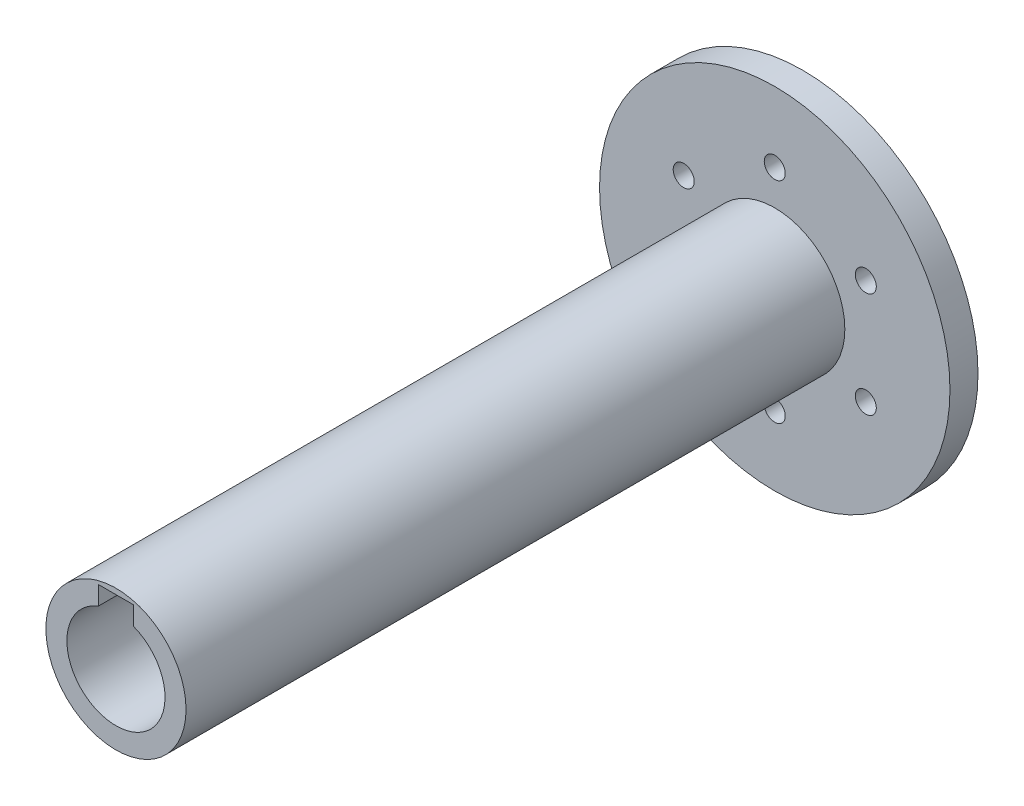
ISO-10303-21;
HEADER;
FILE_DESCRIPTION(('STEP AP214'),'2;1');
FILE_NAME('part.step','',(''),(''),'','','');
FILE_SCHEMA(('AUTOMOTIVE_DESIGN { 1 0 10303 214 1 1 1 1 }'));
ENDSEC;
DATA;
#1=APPLICATION_CONTEXT('core data for automotive mechanical design processes');
#2=APPLICATION_PROTOCOL_DEFINITION('international standard','automotive_design',2000,#1);
#3=PRODUCT_CONTEXT('',#1,'mechanical');
#4=PRODUCT('Part','Part','',(#3));
#5=PRODUCT_RELATED_PRODUCT_CATEGORY('part','',(#4));
#6=PRODUCT_DEFINITION_FORMATION('','',#4);
#7=PRODUCT_DEFINITION_CONTEXT('part definition',#1,'design');
#8=PRODUCT_DEFINITION('design','',#6,#7);
#9=PRODUCT_DEFINITION_SHAPE('','',#8);
#10=(LENGTH_UNIT() NAMED_UNIT(*) SI_UNIT(.MILLI.,.METRE.));
#11=(NAMED_UNIT(*) PLANE_ANGLE_UNIT() SI_UNIT($,.RADIAN.));
#12=(NAMED_UNIT(*) SI_UNIT($,.STERADIAN.) SOLID_ANGLE_UNIT());
#13=UNCERTAINTY_MEASURE_WITH_UNIT(LENGTH_MEASURE(1.E-05),#10,'distance_accuracy_value','');
#14=(GEOMETRIC_REPRESENTATION_CONTEXT(3) GLOBAL_UNCERTAINTY_ASSIGNED_CONTEXT((#13)) GLOBAL_UNIT_ASSIGNED_CONTEXT((#10,
#11,#12)) REPRESENTATION_CONTEXT('',''));
#15=CARTESIAN_POINT('',(0.,0.,0.));
#16=DIRECTION('',(0.,0.,1.));
#17=DIRECTION('',(1.,0.,0.));
#18=AXIS2_PLACEMENT_3D('',#15,#16,#17);
#19=CARTESIAN_POINT('',(0.,0.,94.));
#20=DIRECTION('',(0.,0.,-1.));
#21=DIRECTION('',(-1.,0.,0.));
#22=AXIS2_PLACEMENT_3D('',#19,#20,#21);
#23=CYLINDRICAL_SURFACE('',#22,10.);
#24=CARTESIAN_POINT('',(0.,0.,94.));
#25=DIRECTION('',(0.,0.,1.));
#26=DIRECTION('',(1.,0.,0.));
#27=AXIS2_PLACEMENT_3D('',#24,#25,#26);
#28=CIRCLE('',#27,10.);
#29=CARTESIAN_POINT('',(10.,0.,94.));
#30=VERTEX_POINT('',#29);
#31=EDGE_CURVE('E11',#30,#30,#28,.T.);
#32=ORIENTED_EDGE('',*,*,#31,.F.);
#33=EDGE_LOOP('',(#32));
#34=FACE_BOUND('',#33,.T.);
#35=CARTESIAN_POINT('',(0.,0.,0.));
#36=DIRECTION('',(0.,0.,1.));
#37=DIRECTION('',(1.,0.,0.));
#38=AXIS2_PLACEMENT_3D('',#35,#36,#37);
#39=CIRCLE('',#38,10.);
#40=CARTESIAN_POINT('',(10.,0.,0.));
#41=VERTEX_POINT('',#40);
#42=EDGE_CURVE('E130',#41,#41,#39,.T.);
#43=ORIENTED_EDGE('',*,*,#42,.T.);
#44=EDGE_LOOP('',(#43));
#45=FACE_BOUND('',#44,.T.);
#46=ADVANCED_FACE('F39',(#34,#45),#23,.T.);
#47=CARTESIAN_POINT('',(0.,0.,94.));
#48=DIRECTION('',(0.,0.,1.));
#49=DIRECTION('',(1.,0.,0.));
#50=AXIS2_PLACEMENT_3D('',#47,#48,#49);
#51=PLANE('',#50);
#52=DIRECTION('',(0.,1.,0.));
#53=VECTOR('',#52,1.);
#54=CARTESIAN_POINT('',(2.5,6.53834841531101,94.));
#55=LINE('',#54,#53);
#56=CARTESIAN_POINT('',(2.5,6.53834841531101,94.));
#57=VERTEX_POINT('',#56);
#58=CARTESIAN_POINT('',(2.5,9.2,94.));
#59=VERTEX_POINT('',#58);
#60=EDGE_CURVE('E56',#57,#59,#55,.T.);
#61=ORIENTED_EDGE('',*,*,#60,.F.);
#62=CARTESIAN_POINT('',(0.,0.,94.));
#63=DIRECTION('',(0.,0.,1.));
#64=DIRECTION('',(1.,0.,0.));
#65=AXIS2_PLACEMENT_3D('',#62,#63,#64);
#66=CIRCLE('',#65,7.);
#67=CARTESIAN_POINT('',(-2.5,6.53834841531101,94.));
#68=VERTEX_POINT('',#67);
#69=EDGE_CURVE('E110',#68,#57,#66,.T.);
#70=ORIENTED_EDGE('',*,*,#69,.F.);
#71=DIRECTION('',(0.,-1.,0.));
#72=VECTOR('',#71,1.);
#73=CARTESIAN_POINT('',(-2.5,6.53834841531101,94.));
#74=LINE('',#73,#72);
#75=CARTESIAN_POINT('',(-2.5,9.2,94.));
#76=VERTEX_POINT('',#75);
#77=EDGE_CURVE('E120',#76,#68,#74,.T.);
#78=ORIENTED_EDGE('',*,*,#77,.F.);
#79=DIRECTION('',(-1.,0.,0.));
#80=VECTOR('',#79,1.);
#81=CARTESIAN_POINT('',(-2.5,9.2,94.));
#82=LINE('',#81,#80);
#83=EDGE_CURVE('E90',#59,#76,#82,.T.);
#84=ORIENTED_EDGE('',*,*,#83,.F.);
#85=EDGE_LOOP('',(#61,#70,#78,#84));
#86=FACE_BOUND('',#85,.T.);
#87=ORIENTED_EDGE('',*,*,#31,.T.);
#88=EDGE_LOOP('',(#87));
#89=FACE_BOUND('',#88,.T.);
#90=ADVANCED_FACE('F223',(#86,#89),#51,.T.);
#91=CARTESIAN_POINT('',(2.5,6.53834841531101,64.));
#92=DIRECTION('',(1.,0.,0.));
#93=DIRECTION('',(0.,0.,-1.));
#94=AXIS2_PLACEMENT_3D('',#91,#92,#93);
#95=PLANE('',#94);
#96=ORIENTED_EDGE('',*,*,#60,.T.);
#97=DIRECTION('',(0.,0.,1.));
#98=VECTOR('',#97,1.);
#99=CARTESIAN_POINT('',(2.5,9.2,64.));
#100=LINE('',#99,#98);
#101=CARTESIAN_POINT('',(2.5,9.2,64.));
#102=VERTEX_POINT('',#101);
#103=EDGE_CURVE('E78',#102,#59,#100,.T.);
#104=ORIENTED_EDGE('',*,*,#103,.F.);
#105=DIRECTION('',(0.,1.,0.));
#106=VECTOR('',#105,1.);
#107=CARTESIAN_POINT('',(2.5,6.53834841531101,64.));
#108=LINE('',#107,#106);
#109=CARTESIAN_POINT('',(2.5,6.53834841531101,64.));
#110=VERTEX_POINT('',#109);
#111=EDGE_CURVE('E106',#110,#102,#108,.T.);
#112=ORIENTED_EDGE('',*,*,#111,.F.);
#113=DIRECTION('',(0.,0.,1.));
#114=VECTOR('',#113,1.);
#115=CARTESIAN_POINT('',(2.5,6.53834841531101,64.));
#116=LINE('',#115,#114);
#117=EDGE_CURVE('E48',#110,#57,#116,.T.);
#118=ORIENTED_EDGE('',*,*,#117,.T.);
#119=EDGE_LOOP('',(#96,#104,#112,#118));
#120=FACE_BOUND('',#119,.T.);
#121=ADVANCED_FACE('F228',(#120),#95,.F.);
#122=CARTESIAN_POINT('',(0.,0.,64.));
#123=DIRECTION('',(0.,0.,1.));
#124=DIRECTION('',(1.,0.,0.));
#125=AXIS2_PLACEMENT_3D('',#122,#123,#124);
#126=CYLINDRICAL_SURFACE('',#125,7.);
#127=ORIENTED_EDGE('',*,*,#69,.T.);
#128=ORIENTED_EDGE('',*,*,#117,.F.);
#129=CARTESIAN_POINT('',(0.,0.,64.));
#130=DIRECTION('',(0.,0.,1.));
#131=DIRECTION('',(1.,0.,0.));
#132=AXIS2_PLACEMENT_3D('',#129,#130,#131);
#133=CIRCLE('',#132,7.);
#134=CARTESIAN_POINT('',(-2.5,6.53834841531101,64.));
#135=VERTEX_POINT('',#134);
#136=EDGE_CURVE('E103',#135,#110,#133,.T.);
#137=ORIENTED_EDGE('',*,*,#136,.F.);
#138=DIRECTION('',(0.,0.,1.));
#139=VECTOR('',#138,1.);
#140=CARTESIAN_POINT('',(-2.5,6.53834841531101,64.));
#141=LINE('',#140,#139);
#142=EDGE_CURVE('E95',#135,#68,#141,.T.);
#143=ORIENTED_EDGE('',*,*,#142,.T.);
#144=EDGE_LOOP('',(#127,#128,#137,#143));
#145=FACE_BOUND('',#144,.T.);
#146=ADVANCED_FACE('F235',(#145),#126,.F.);
#147=CARTESIAN_POINT('',(-2.5,6.53834841531101,64.));
#148=DIRECTION('',(-1.,0.,0.));
#149=DIRECTION('',(0.,0.,1.));
#150=AXIS2_PLACEMENT_3D('',#147,#148,#149);
#151=PLANE('',#150);
#152=ORIENTED_EDGE('',*,*,#77,.T.);
#153=ORIENTED_EDGE('',*,*,#142,.F.);
#154=DIRECTION('',(0.,-1.,0.));
#155=VECTOR('',#154,1.);
#156=CARTESIAN_POINT('',(-2.5,6.53834841531101,64.));
#157=LINE('',#156,#155);
#158=CARTESIAN_POINT('',(-2.5,9.2,64.));
#159=VERTEX_POINT('',#158);
#160=EDGE_CURVE('E98',#159,#135,#157,.T.);
#161=ORIENTED_EDGE('',*,*,#160,.F.);
#162=DIRECTION('',(0.,0.,1.));
#163=VECTOR('',#162,1.);
#164=CARTESIAN_POINT('',(-2.5,9.2,64.));
#165=LINE('',#164,#163);
#166=EDGE_CURVE('E83',#159,#76,#165,.T.);
#167=ORIENTED_EDGE('',*,*,#166,.T.);
#168=EDGE_LOOP('',(#152,#153,#161,#167));
#169=FACE_BOUND('',#168,.T.);
#170=ADVANCED_FACE('F99',(#169),#151,.F.);
#171=CARTESIAN_POINT('',(-2.5,9.2,64.));
#172=DIRECTION('',(0.,1.,0.));
#173=DIRECTION('',(0.,0.,1.));
#174=AXIS2_PLACEMENT_3D('',#171,#172,#173);
#175=PLANE('',#174);
#176=ORIENTED_EDGE('',*,*,#83,.T.);
#177=ORIENTED_EDGE('',*,*,#166,.F.);
#178=DIRECTION('',(-1.,0.,0.));
#179=VECTOR('',#178,1.);
#180=CARTESIAN_POINT('',(-2.5,9.2,64.));
#181=LINE('',#180,#179);
#182=EDGE_CURVE('E87',#102,#159,#181,.T.);
#183=ORIENTED_EDGE('',*,*,#182,.F.);
#184=ORIENTED_EDGE('',*,*,#103,.T.);
#185=EDGE_LOOP('',(#176,#177,#183,#184));
#186=FACE_BOUND('',#185,.T.);
#187=ADVANCED_FACE('F85',(#186),#175,.F.);
#188=CARTESIAN_POINT('',(0.,0.,64.));
#189=DIRECTION('',(0.,0.,1.));
#190=DIRECTION('',(1.,0.,0.));
#191=AXIS2_PLACEMENT_3D('',#188,#189,#190);
#192=PLANE('',#191);
#193=CARTESIAN_POINT('',(0.,0.,64.));
#194=DIRECTION('',(0.,0.,1.));
#195=DIRECTION('',(1.,0.,0.));
#196=AXIS2_PLACEMENT_3D('',#193,#194,#195);
#197=CIRCLE('',#196,1.5);
#198=CARTESIAN_POINT('',(1.5,0.,64.));
#199=VERTEX_POINT('',#198);
#200=EDGE_CURVE('E42',#199,#199,#197,.T.);
#201=ORIENTED_EDGE('',*,*,#200,.F.);
#202=EDGE_LOOP('',(#201));
#203=FACE_BOUND('',#202,.T.);
#204=ORIENTED_EDGE('',*,*,#111,.T.);
#205=ORIENTED_EDGE('',*,*,#182,.T.);
#206=ORIENTED_EDGE('',*,*,#160,.T.);
#207=ORIENTED_EDGE('',*,*,#136,.T.);
#208=EDGE_LOOP('',(#204,#205,#206,#207));
#209=FACE_BOUND('',#208,.T.);
#210=ADVANCED_FACE('F105',(#203,#209),#192,.T.);
#211=CARTESIAN_POINT('',(0.,0.,94.));
#212=DIRECTION('',(0.,0.,-1.));
#213=DIRECTION('',(-1.,0.,0.));
#214=AXIS2_PLACEMENT_3D('',#211,#212,#213);
#215=CYLINDRICAL_SURFACE('',#214,1.5);
#216=ORIENTED_EDGE('',*,*,#200,.T.);
#217=EDGE_LOOP('',(#216));
#218=FACE_BOUND('',#217,.T.);
#219=CARTESIAN_POINT('',(0.,0.,-4.));
#220=DIRECTION('',(0.,0.,-1.));
#221=DIRECTION('',(-1.,0.,0.));
#222=AXIS2_PLACEMENT_3D('',#219,#220,#221);
#223=CIRCLE('',#222,1.5);
#224=CARTESIAN_POINT('',(-1.5,0.,-4.));
#225=VERTEX_POINT('',#224);
#226=EDGE_CURVE('E146',#225,#225,#223,.T.);
#227=ORIENTED_EDGE('',*,*,#226,.T.);
#228=EDGE_LOOP('',(#227));
#229=FACE_BOUND('',#228,.T.);
#230=ADVANCED_FACE('F206',(#218,#229),#215,.F.);
#231=CARTESIAN_POINT('',(0.,0.,-4.));
#232=DIRECTION('',(0.,0.,-1.));
#233=DIRECTION('',(-1.,0.,0.));
#234=AXIS2_PLACEMENT_3D('',#231,#232,#233);
#235=PLANE('',#234);
#236=CARTESIAN_POINT('',(12.9903810567663,7.49999999999944,-4.));
#237=DIRECTION('',(0.,0.,-1.));
#238=DIRECTION('',(-1.,0.,0.));
#239=AXIS2_PLACEMENT_3D('',#236,#237,#238);
#240=CIRCLE('',#239,1.50000000000065);
#241=CARTESIAN_POINT('',(11.4903810567656,7.49999999999944,-4.));
#242=VERTEX_POINT('',#241);
#243=EDGE_CURVE('E164',#242,#242,#240,.T.);
#244=ORIENTED_EDGE('',*,*,#243,.F.);
#245=EDGE_LOOP('',(#244));
#246=FACE_BOUND('',#245,.T.);
#247=CARTESIAN_POINT('',(0.,15.,-4.));
#248=DIRECTION('',(0.,0.,-1.));
#249=DIRECTION('',(-1.,0.,0.));
#250=AXIS2_PLACEMENT_3D('',#247,#248,#249);
#251=CIRCLE('',#250,1.5);
#252=CARTESIAN_POINT('',(-1.5,15.,-4.));
#253=VERTEX_POINT('',#252);
#254=EDGE_CURVE('E172',#253,#253,#251,.T.);
#255=ORIENTED_EDGE('',*,*,#254,.F.);
#256=EDGE_LOOP('',(#255));
#257=FACE_BOUND('',#256,.T.);
#258=CARTESIAN_POINT('',(-12.9903810567669,7.50000000000056,-4.));
#259=DIRECTION('',(0.,0.,-1.));
#260=DIRECTION('',(-1.,0.,0.));
#261=AXIS2_PLACEMENT_3D('',#258,#259,#260);
#262=CIRCLE('',#261,1.50000000000018);
#263=CARTESIAN_POINT('',(-14.4903810567671,7.50000000000056,-4.));
#264=VERTEX_POINT('',#263);
#265=EDGE_CURVE('E180',#264,#264,#262,.T.);
#266=ORIENTED_EDGE('',*,*,#265,.F.);
#267=EDGE_LOOP('',(#266));
#268=FACE_BOUND('',#267,.T.);
#269=CARTESIAN_POINT('',(-12.9903810567675,-7.49999999999945,-4.));
#270=DIRECTION('',(0.,0.,-1.));
#271=DIRECTION('',(-1.,0.,0.));
#272=AXIS2_PLACEMENT_3D('',#269,#270,#271);
#273=CIRCLE('',#272,1.50000000000083);
#274=CARTESIAN_POINT('',(-14.4903810567684,-7.49999999999945,-4.));
#275=VERTEX_POINT('',#274);
#276=EDGE_CURVE('E188',#275,#275,#273,.T.);
#277=ORIENTED_EDGE('',*,*,#276,.F.);
#278=EDGE_LOOP('',(#277));
#279=FACE_BOUND('',#278,.T.);
#280=CARTESIAN_POINT('',(-1.27652763076989E-12,-15.,-4.));
#281=DIRECTION('',(0.,0.,-1.));
#282=DIRECTION('',(-1.,0.,0.));
#283=AXIS2_PLACEMENT_3D('',#280,#281,#282);
#284=CIRCLE('',#283,1.50000000000132);
#285=CARTESIAN_POINT('',(-1.5000000000026,-15.,-4.));
#286=VERTEX_POINT('',#285);
#287=EDGE_CURVE('E156',#286,#286,#284,.T.);
#288=ORIENTED_EDGE('',*,*,#287,.F.);
#289=EDGE_LOOP('',(#288));
#290=FACE_BOUND('',#289,.T.);
#291=CARTESIAN_POINT('',(12.9903810567656,-7.50000000000056,-4.));
#292=DIRECTION('',(0.,0.,-1.));
#293=DIRECTION('',(-1.,0.,0.));
#294=AXIS2_PLACEMENT_3D('',#291,#292,#293);
#295=CIRCLE('',#294,1.50000000000122);
#296=CARTESIAN_POINT('',(11.4903810567644,-7.50000000000056,-4.));
#297=VERTEX_POINT('',#296);
#298=EDGE_CURVE('E152',#297,#297,#295,.T.);
#299=ORIENTED_EDGE('',*,*,#298,.F.);
#300=EDGE_LOOP('',(#299));
#301=FACE_BOUND('',#300,.T.);
#302=CARTESIAN_POINT('',(0.,0.,-4.));
#303=DIRECTION('',(0.,0.,-1.));
#304=DIRECTION('',(-1.,0.,0.));
#305=AXIS2_PLACEMENT_3D('',#302,#303,#304);
#306=CIRCLE('',#305,25.);
#307=CARTESIAN_POINT('',(-25.,0.,-4.));
#308=VERTEX_POINT('',#307);
#309=EDGE_CURVE('E133',#308,#308,#306,.T.);
#310=ORIENTED_EDGE('',*,*,#309,.T.);
#311=EDGE_LOOP('',(#310));
#312=FACE_BOUND('',#311,.T.);
#313=ORIENTED_EDGE('',*,*,#226,.F.);
#314=EDGE_LOOP('',(#313));
#315=FACE_BOUND('',#314,.T.);
#316=ADVANCED_FACE('F202',(#246,#257,#268,#279,#290,#301,#312,#315),#235,.T.);
#317=CARTESIAN_POINT('',(0.,0.,0.));
#318=DIRECTION('',(0.,0.,-1.));
#319=DIRECTION('',(-1.,0.,0.));
#320=AXIS2_PLACEMENT_3D('',#317,#318,#319);
#321=PLANE('',#320);
#322=CARTESIAN_POINT('',(12.9903810567663,7.49999999999944,0.));
#323=DIRECTION('',(0.,0.,-1.));
#324=DIRECTION('',(-1.,0.,0.));
#325=AXIS2_PLACEMENT_3D('',#322,#323,#324);
#326=CIRCLE('',#325,1.50000000000065);
#327=CARTESIAN_POINT('',(11.4903810567656,7.49999999999944,0.));
#328=VERTEX_POINT('',#327);
#329=EDGE_CURVE('E160',#328,#328,#326,.T.);
#330=ORIENTED_EDGE('',*,*,#329,.T.);
#331=EDGE_LOOP('',(#330));
#332=FACE_BOUND('',#331,.T.);
#333=CARTESIAN_POINT('',(0.,15.,0.));
#334=DIRECTION('',(0.,0.,-1.));
#335=DIRECTION('',(-1.,0.,0.));
#336=AXIS2_PLACEMENT_3D('',#333,#334,#335);
#337=CIRCLE('',#336,1.5);
#338=CARTESIAN_POINT('',(-1.5,15.,0.));
#339=VERTEX_POINT('',#338);
#340=EDGE_CURVE('E168',#339,#339,#337,.T.);
#341=ORIENTED_EDGE('',*,*,#340,.T.);
#342=EDGE_LOOP('',(#341));
#343=FACE_BOUND('',#342,.T.);
#344=CARTESIAN_POINT('',(-12.9903810567669,7.50000000000056,0.));
#345=DIRECTION('',(0.,0.,-1.));
#346=DIRECTION('',(-1.,0.,0.));
#347=AXIS2_PLACEMENT_3D('',#344,#345,#346);
#348=CIRCLE('',#347,1.50000000000018);
#349=CARTESIAN_POINT('',(-14.4903810567671,7.50000000000056,0.));
#350=VERTEX_POINT('',#349);
#351=EDGE_CURVE('E176',#350,#350,#348,.T.);
#352=ORIENTED_EDGE('',*,*,#351,.T.);
#353=EDGE_LOOP('',(#352));
#354=FACE_BOUND('',#353,.T.);
#355=CARTESIAN_POINT('',(-12.9903810567675,-7.49999999999945,0.));
#356=DIRECTION('',(0.,0.,-1.));
#357=DIRECTION('',(-1.,0.,0.));
#358=AXIS2_PLACEMENT_3D('',#355,#356,#357);
#359=CIRCLE('',#358,1.50000000000083);
#360=CARTESIAN_POINT('',(-14.4903810567684,-7.49999999999945,0.));
#361=VERTEX_POINT('',#360);
#362=EDGE_CURVE('E184',#361,#361,#359,.T.);
#363=ORIENTED_EDGE('',*,*,#362,.T.);
#364=EDGE_LOOP('',(#363));
#365=FACE_BOUND('',#364,.T.);
#366=CARTESIAN_POINT('',(-1.27652763076989E-12,-15.,0.));
#367=DIRECTION('',(0.,0.,-1.));
#368=DIRECTION('',(-1.,0.,0.));
#369=AXIS2_PLACEMENT_3D('',#366,#367,#368);
#370=CIRCLE('',#369,1.50000000000132);
#371=CARTESIAN_POINT('',(-1.5000000000026,-15.,0.));
#372=VERTEX_POINT('',#371);
#373=EDGE_CURVE('E192',#372,#372,#370,.T.);
#374=ORIENTED_EDGE('',*,*,#373,.T.);
#375=EDGE_LOOP('',(#374));
#376=FACE_BOUND('',#375,.T.);
#377=CARTESIAN_POINT('',(12.9903810567656,-7.50000000000056,0.));
#378=DIRECTION('',(0.,0.,-1.));
#379=DIRECTION('',(-1.,0.,0.));
#380=AXIS2_PLACEMENT_3D('',#377,#378,#379);
#381=CIRCLE('',#380,1.50000000000122);
#382=CARTESIAN_POINT('',(11.4903810567644,-7.50000000000056,0.));
#383=VERTEX_POINT('',#382);
#384=EDGE_CURVE('E151',#383,#383,#381,.T.);
#385=ORIENTED_EDGE('',*,*,#384,.T.);
#386=EDGE_LOOP('',(#385));
#387=FACE_BOUND('',#386,.T.);
#388=ORIENTED_EDGE('',*,*,#42,.F.);
#389=EDGE_LOOP('',(#388));
#390=FACE_BOUND('',#389,.T.);
#391=CARTESIAN_POINT('',(0.,0.,0.));
#392=DIRECTION('',(0.,0.,-1.));
#393=DIRECTION('',(-1.,0.,0.));
#394=AXIS2_PLACEMENT_3D('',#391,#392,#393);
#395=CIRCLE('',#394,25.);
#396=CARTESIAN_POINT('',(-25.,0.,0.));
#397=VERTEX_POINT('',#396);
#398=EDGE_CURVE('E140',#397,#397,#395,.T.);
#399=ORIENTED_EDGE('',*,*,#398,.F.);
#400=EDGE_LOOP('',(#399));
#401=FACE_BOUND('',#400,.T.);
#402=ADVANCED_FACE('F205',(#332,#343,#354,#365,#376,#387,#390,#401),#321,.F.);
#403=CARTESIAN_POINT('',(0.,0.,-4.));
#404=DIRECTION('',(0.,0.,1.));
#405=DIRECTION('',(1.,0.,0.));
#406=AXIS2_PLACEMENT_3D('',#403,#404,#405);
#407=CYLINDRICAL_SURFACE('',#406,25.);
#408=ORIENTED_EDGE('',*,*,#309,.F.);
#409=EDGE_LOOP('',(#408));
#410=FACE_BOUND('',#409,.T.);
#411=ORIENTED_EDGE('',*,*,#398,.T.);
#412=EDGE_LOOP('',(#411));
#413=FACE_BOUND('',#412,.T.);
#414=ADVANCED_FACE('F271',(#410,#413),#407,.T.);
#415=CARTESIAN_POINT('',(12.9903810567656,-7.50000000000056,0.));
#416=DIRECTION('',(0.,0.,-1.));
#417=DIRECTION('',(-1.,0.,0.));
#418=AXIS2_PLACEMENT_3D('',#415,#416,#417);
#419=CYLINDRICAL_SURFACE('',#418,1.50000000000122);
#420=ORIENTED_EDGE('',*,*,#384,.F.);
#421=EDGE_LOOP('',(#420));
#422=FACE_BOUND('',#421,.T.);
#423=ORIENTED_EDGE('',*,*,#298,.T.);
#424=EDGE_LOOP('',(#423));
#425=FACE_BOUND('',#424,.T.);
#426=ADVANCED_FACE('F276',(#422,#425),#419,.F.);
#427=CARTESIAN_POINT('',(-1.27652763076989E-12,-15.,0.));
#428=DIRECTION('',(0.,0.,-1.));
#429=DIRECTION('',(-1.,0.,0.));
#430=AXIS2_PLACEMENT_3D('',#427,#428,#429);
#431=CYLINDRICAL_SURFACE('',#430,1.50000000000132);
#432=ORIENTED_EDGE('',*,*,#373,.F.);
#433=EDGE_LOOP('',(#432));
#434=FACE_BOUND('',#433,.T.);
#435=ORIENTED_EDGE('',*,*,#287,.T.);
#436=EDGE_LOOP('',(#435));
#437=FACE_BOUND('',#436,.T.);
#438=ADVANCED_FACE('F200',(#434,#437),#431,.F.);
#439=CARTESIAN_POINT('',(-12.9903810567675,-7.49999999999945,0.));
#440=DIRECTION('',(0.,0.,-1.));
#441=DIRECTION('',(-1.,0.,0.));
#442=AXIS2_PLACEMENT_3D('',#439,#440,#441);
#443=CYLINDRICAL_SURFACE('',#442,1.50000000000083);
#444=ORIENTED_EDGE('',*,*,#362,.F.);
#445=EDGE_LOOP('',(#444));
#446=FACE_BOUND('',#445,.T.);
#447=ORIENTED_EDGE('',*,*,#276,.T.);
#448=EDGE_LOOP('',(#447));
#449=FACE_BOUND('',#448,.T.);
#450=ADVANCED_FACE('F308',(#446,#449),#443,.F.);
#451=CARTESIAN_POINT('',(-12.9903810567669,7.50000000000056,0.));
#452=DIRECTION('',(0.,0.,-1.));
#453=DIRECTION('',(-1.,0.,0.));
#454=AXIS2_PLACEMENT_3D('',#451,#452,#453);
#455=CYLINDRICAL_SURFACE('',#454,1.50000000000018);
#456=ORIENTED_EDGE('',*,*,#351,.F.);
#457=EDGE_LOOP('',(#456));
#458=FACE_BOUND('',#457,.T.);
#459=ORIENTED_EDGE('',*,*,#265,.T.);
#460=EDGE_LOOP('',(#459));
#461=FACE_BOUND('',#460,.T.);
#462=ADVANCED_FACE('F318',(#458,#461),#455,.F.);
#463=CARTESIAN_POINT('',(0.,15.,0.));
#464=DIRECTION('',(0.,0.,-1.));
#465=DIRECTION('',(-1.,0.,0.));
#466=AXIS2_PLACEMENT_3D('',#463,#464,#465);
#467=CYLINDRICAL_SURFACE('',#466,1.5);
#468=ORIENTED_EDGE('',*,*,#340,.F.);
#469=EDGE_LOOP('',(#468));
#470=FACE_BOUND('',#469,.T.);
#471=ORIENTED_EDGE('',*,*,#254,.T.);
#472=EDGE_LOOP('',(#471));
#473=FACE_BOUND('',#472,.T.);
#474=ADVANCED_FACE('F328',(#470,#473),#467,.F.);
#475=CARTESIAN_POINT('',(12.9903810567663,7.49999999999944,0.));
#476=DIRECTION('',(0.,0.,-1.));
#477=DIRECTION('',(-1.,0.,0.));
#478=AXIS2_PLACEMENT_3D('',#475,#476,#477);
#479=CYLINDRICAL_SURFACE('',#478,1.50000000000065);
#480=ORIENTED_EDGE('',*,*,#329,.F.);
#481=EDGE_LOOP('',(#480));
#482=FACE_BOUND('',#481,.T.);
#483=ORIENTED_EDGE('',*,*,#243,.T.);
#484=EDGE_LOOP('',(#483));
#485=FACE_BOUND('',#484,.T.);
#486=ADVANCED_FACE('F338',(#482,#485),#479,.F.);
#487=CLOSED_SHELL('',(#46,#90,#121,#146,#170,#187,#210,#230,#316,#402,#414,#426,#438,#450,#462,
#474,#486));
#488=MANIFOLD_SOLID_BREP('B2',#487);
#489=ADVANCED_BREP_SHAPE_REPRESENTATION('',(#18,#488),#14);
#490=SHAPE_DEFINITION_REPRESENTATION(#9,#489);
ENDSEC;
END-ISO-10303-21;
